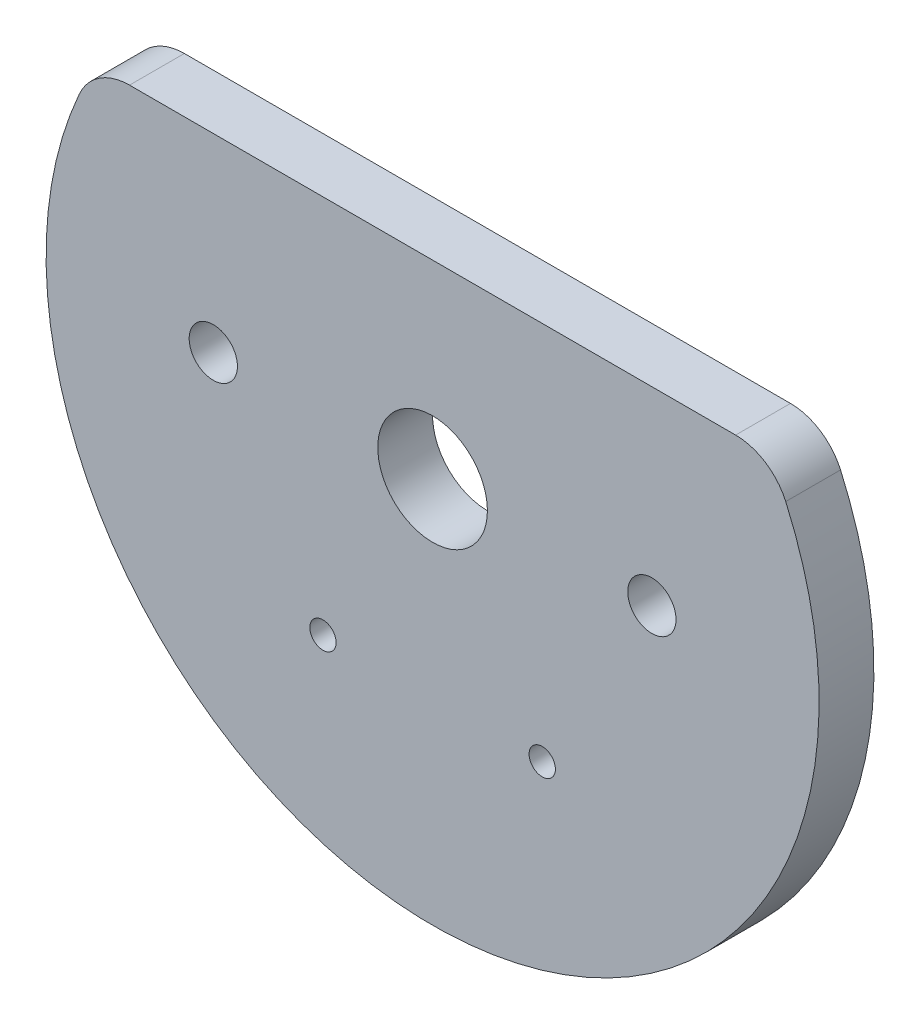
ISO-10303-21;
HEADER;
FILE_DESCRIPTION(('STEP AP214'),'2;1');
FILE_NAME('part.step','',(''),(''),'','','');
FILE_SCHEMA(('AUTOMOTIVE_DESIGN { 1 0 10303 214 1 1 1 1 }'));
ENDSEC;
DATA;
#1=APPLICATION_CONTEXT('core data for automotive mechanical design processes');
#2=APPLICATION_PROTOCOL_DEFINITION('international standard','automotive_design',2000,#1);
#3=PRODUCT_CONTEXT('',#1,'mechanical');
#4=PRODUCT('Part','Part','',(#3));
#5=PRODUCT_RELATED_PRODUCT_CATEGORY('part','',(#4));
#6=PRODUCT_DEFINITION_FORMATION('','',#4);
#7=PRODUCT_DEFINITION_CONTEXT('part definition',#1,'design');
#8=PRODUCT_DEFINITION('design','',#6,#7);
#9=PRODUCT_DEFINITION_SHAPE('','',#8);
#10=(LENGTH_UNIT() NAMED_UNIT(*) SI_UNIT(.MILLI.,.METRE.));
#11=(NAMED_UNIT(*) PLANE_ANGLE_UNIT() SI_UNIT($,.RADIAN.));
#12=(NAMED_UNIT(*) SI_UNIT($,.STERADIAN.) SOLID_ANGLE_UNIT());
#13=UNCERTAINTY_MEASURE_WITH_UNIT(LENGTH_MEASURE(1.E-05),#10,'distance_accuracy_value','');
#14=(GEOMETRIC_REPRESENTATION_CONTEXT(3) GLOBAL_UNCERTAINTY_ASSIGNED_CONTEXT((#13)) GLOBAL_UNIT_ASSIGNED_CONTEXT((#10,
#11,#12)) REPRESENTATION_CONTEXT('',''));
#15=CARTESIAN_POINT('',(0.,0.,0.));
#16=DIRECTION('',(0.,0.,1.));
#17=DIRECTION('',(1.,0.,0.));
#18=AXIS2_PLACEMENT_3D('',#15,#16,#17);
#19=CARTESIAN_POINT('',(69.0541023726342,-28.6031457402453,3.175));
#20=DIRECTION('',(0.,0.,-1.));
#21=DIRECTION('',(-1.,0.,0.));
#22=AXIS2_PLACEMENT_3D('',#19,#20,#21);
#23=CYLINDRICAL_SURFACE('',#22,22.38375);
#24=CARTESIAN_POINT('',(69.0541023726342,-28.6031457402453,0.));
#25=DIRECTION('',(0.,0.,1.));
#26=DIRECTION('',(1.,0.,0.));
#27=AXIS2_PLACEMENT_3D('',#24,#25,#26);
#28=CIRCLE('',#27,22.38375);
#29=CARTESIAN_POINT('',(48.6023586338379,-19.5059790326871,0.));
#30=VERTEX_POINT('',#29);
#31=CARTESIAN_POINT('',(89.5058461114306,-19.5059790326871,0.));
#32=VERTEX_POINT('',#31);
#33=EDGE_CURVE('E37',#30,#32,#28,.T.);
#34=ORIENTED_EDGE('',*,*,#33,.T.);
#35=DIRECTION('',(0.,0.,-1.));
#36=VECTOR('',#35,1.);
#37=CARTESIAN_POINT('',(89.5058461114306,-19.5059790326871,1.5875));
#38=LINE('',#37,#36);
#39=CARTESIAN_POINT('',(89.5058461114306,-19.5059790326871,3.175));
#40=VERTEX_POINT('',#39);
#41=EDGE_CURVE('E123',#40,#32,#38,.T.);
#42=ORIENTED_EDGE('',*,*,#41,.F.);
#43=CARTESIAN_POINT('',(69.0541023726342,-28.6031457402453,3.175));
#44=DIRECTION('',(0.,0.,1.));
#45=DIRECTION('',(1.,0.,0.));
#46=AXIS2_PLACEMENT_3D('',#43,#44,#45);
#47=CIRCLE('',#46,22.38375);
#48=CARTESIAN_POINT('',(48.6023586338379,-19.5059790326872,3.175));
#49=VERTEX_POINT('',#48);
#50=EDGE_CURVE('E11',#49,#40,#47,.T.);
#51=ORIENTED_EDGE('',*,*,#50,.F.);
#52=DIRECTION('',(0.,0.,-1.));
#53=VECTOR('',#52,1.);
#54=CARTESIAN_POINT('',(48.6023586338379,-19.5059790326872,1.5875));
#55=LINE('',#54,#53);
#56=EDGE_CURVE('E121',#30,#49,#55,.F.);
#57=ORIENTED_EDGE('',*,*,#56,.F.);
#58=EDGE_LOOP('',(#34,#42,#51,#57));
#59=FACE_BOUND('',#58,.T.);
#60=ADVANCED_FACE('F34',(#59),#23,.T.);
#61=CARTESIAN_POINT('',(69.0541023726342,-28.6031457402453,3.175));
#62=DIRECTION('',(0.,0.,1.));
#63=DIRECTION('',(1.,0.,0.));
#64=AXIS2_PLACEMENT_3D('',#61,#62,#63);
#65=PLANE('',#64);
#66=CARTESIAN_POINT('',(69.0541023726342,-28.6031457402453,3.175));
#67=DIRECTION('',(0.,0.,1.));
#68=DIRECTION('',(1.,0.,0.));
#69=AXIS2_PLACEMENT_3D('',#66,#67,#68);
#70=CIRCLE('',#69,3.175);
#71=CARTESIAN_POINT('',(72.2291023726342,-28.6031457402453,3.175));
#72=VERTEX_POINT('',#71);
#73=EDGE_CURVE('E169',#72,#72,#70,.T.);
#74=ORIENTED_EDGE('',*,*,#73,.F.);
#75=EDGE_LOOP('',(#74));
#76=FACE_BOUND('',#75,.T.);
#77=CARTESIAN_POINT('',(75.4041023726343,-39.6016683683077,3.175));
#78=DIRECTION('',(0.,0.,1.));
#79=DIRECTION('',(1.,0.,0.));
#80=AXIS2_PLACEMENT_3D('',#77,#78,#79);
#81=CIRCLE('',#80,0.762000000000003);
#82=CARTESIAN_POINT('',(76.1661023726343,-39.6016683683077,3.175));
#83=VERTEX_POINT('',#82);
#84=EDGE_CURVE('E96',#83,#83,#81,.T.);
#85=ORIENTED_EDGE('',*,*,#84,.F.);
#86=EDGE_LOOP('',(#85));
#87=FACE_BOUND('',#86,.T.);
#88=CARTESIAN_POINT('',(62.7041023726342,-39.6016683683077,3.175));
#89=DIRECTION('',(0.,0.,1.));
#90=DIRECTION('',(1.,0.,0.));
#91=AXIS2_PLACEMENT_3D('',#88,#89,#90);
#92=CIRCLE('',#91,0.762000000000003);
#93=CARTESIAN_POINT('',(63.4661023726342,-39.6016683683077,3.175));
#94=VERTEX_POINT('',#93);
#95=EDGE_CURVE('E103',#94,#94,#92,.T.);
#96=ORIENTED_EDGE('',*,*,#95,.F.);
#97=EDGE_LOOP('',(#96));
#98=FACE_BOUND('',#97,.T.);
#99=CARTESIAN_POINT('',(81.7541023726343,-28.6031457402453,3.175));
#100=DIRECTION('',(0.,0.,1.));
#101=DIRECTION('',(-1.,0.,0.));
#102=AXIS2_PLACEMENT_3D('',#99,#100,#101);
#103=CIRCLE('',#102,1.39699999999999);
#104=CARTESIAN_POINT('',(80.3571023726343,-28.6031457402453,3.175));
#105=VERTEX_POINT('',#104);
#106=EDGE_CURVE('E109',#105,#105,#103,.T.);
#107=ORIENTED_EDGE('',*,*,#106,.F.);
#108=EDGE_LOOP('',(#107));
#109=FACE_BOUND('',#108,.T.);
#110=CARTESIAN_POINT('',(56.3541023726342,-28.6031457402453,3.175));
#111=DIRECTION('',(0.,0.,1.));
#112=DIRECTION('',(1.,0.,0.));
#113=AXIS2_PLACEMENT_3D('',#110,#111,#112);
#114=CIRCLE('',#113,1.39700000000001);
#115=CARTESIAN_POINT('',(57.7511023726343,-28.6031457402453,3.175));
#116=VERTEX_POINT('',#115);
#117=EDGE_CURVE('E115',#116,#116,#114,.T.);
#118=ORIENTED_EDGE('',*,*,#117,.F.);
#119=EDGE_LOOP('',(#118));
#120=FACE_BOUND('',#119,.T.);
#121=ORIENTED_EDGE('',*,*,#50,.T.);
#122=CARTESIAN_POINT('',(86.6048895527361,-20.7963572890784,3.175));
#123=DIRECTION('',(0.,0.,1.));
#124=DIRECTION('',(1.,0.,0.));
#125=AXIS2_PLACEMENT_3D('',#122,#123,#124);
#126=CIRCLE('',#125,3.17500000000001);
#127=CARTESIAN_POINT('',(86.6048895527361,-17.6213572890784,3.175));
#128=VERTEX_POINT('',#127);
#129=EDGE_CURVE('E75',#40,#128,#126,.T.);
#130=ORIENTED_EDGE('',*,*,#129,.T.);
#131=DIRECTION('',(-1.,0.,0.));
#132=VECTOR('',#131,1.);
#133=CARTESIAN_POINT('',(51.5033151925324,-17.6213572890784,3.175));
#134=LINE('',#133,#132);
#135=CARTESIAN_POINT('',(51.5033151925324,-17.6213572890784,3.175));
#136=VERTEX_POINT('',#135);
#137=EDGE_CURVE('E81',#128,#136,#134,.T.);
#138=ORIENTED_EDGE('',*,*,#137,.T.);
#139=CARTESIAN_POINT('',(51.5033151925324,-20.7963572890784,3.175));
#140=DIRECTION('',(0.,0.,1.));
#141=DIRECTION('',(-1.,0.,0.));
#142=AXIS2_PLACEMENT_3D('',#139,#140,#141);
#143=CIRCLE('',#142,3.175);
#144=EDGE_CURVE('E87',#136,#49,#143,.T.);
#145=ORIENTED_EDGE('',*,*,#144,.T.);
#146=EDGE_LOOP('',(#121,#130,#138,#145));
#147=FACE_BOUND('',#146,.T.);
#148=ADVANCED_FACE('F85',(#76,#87,#98,#109,#120,#147),#65,.T.);
#149=CARTESIAN_POINT('',(69.0541023726342,-28.6031457402453,0.));
#150=DIRECTION('',(0.,0.,1.));
#151=DIRECTION('',(1.,0.,0.));
#152=AXIS2_PLACEMENT_3D('',#149,#150,#151);
#153=PLANE('',#152);
#154=CARTESIAN_POINT('',(69.0541023726342,-28.6031457402453,0.));
#155=DIRECTION('',(0.,0.,1.));
#156=DIRECTION('',(1.,0.,0.));
#157=AXIS2_PLACEMENT_3D('',#154,#155,#156);
#158=CIRCLE('',#157,3.175);
#159=CARTESIAN_POINT('',(72.2291023726342,-28.6031457402453,0.));
#160=VERTEX_POINT('',#159);
#161=EDGE_CURVE('E172',#160,#160,#158,.F.);
#162=ORIENTED_EDGE('',*,*,#161,.F.);
#163=EDGE_LOOP('',(#162));
#164=FACE_BOUND('',#163,.T.);
#165=CARTESIAN_POINT('',(75.4041023726343,-39.6016683683077,0.));
#166=DIRECTION('',(0.,0.,1.));
#167=DIRECTION('',(1.,0.,0.));
#168=AXIS2_PLACEMENT_3D('',#165,#166,#167);
#169=CIRCLE('',#168,0.762000000000003);
#170=CARTESIAN_POINT('',(76.1661023726343,-39.6016683683077,0.));
#171=VERTEX_POINT('',#170);
#172=EDGE_CURVE('E99',#171,#171,#169,.F.);
#173=ORIENTED_EDGE('',*,*,#172,.F.);
#174=EDGE_LOOP('',(#173));
#175=FACE_BOUND('',#174,.T.);
#176=CARTESIAN_POINT('',(62.7041023726342,-39.6016683683077,0.));
#177=DIRECTION('',(0.,0.,1.));
#178=DIRECTION('',(1.,0.,0.));
#179=AXIS2_PLACEMENT_3D('',#176,#177,#178);
#180=CIRCLE('',#179,0.762000000000003);
#181=CARTESIAN_POINT('',(63.4661023726342,-39.6016683683077,0.));
#182=VERTEX_POINT('',#181);
#183=EDGE_CURVE('E106',#182,#182,#180,.F.);
#184=ORIENTED_EDGE('',*,*,#183,.F.);
#185=EDGE_LOOP('',(#184));
#186=FACE_BOUND('',#185,.T.);
#187=CARTESIAN_POINT('',(81.7541023726343,-28.6031457402453,0.));
#188=DIRECTION('',(0.,0.,1.));
#189=DIRECTION('',(1.,0.,0.));
#190=AXIS2_PLACEMENT_3D('',#187,#188,#189);
#191=CIRCLE('',#190,1.39699999999999);
#192=CARTESIAN_POINT('',(83.1511023726342,-28.6031457402453,0.));
#193=VERTEX_POINT('',#192);
#194=EDGE_CURVE('E112',#193,#193,#191,.F.);
#195=ORIENTED_EDGE('',*,*,#194,.F.);
#196=EDGE_LOOP('',(#195));
#197=FACE_BOUND('',#196,.T.);
#198=CARTESIAN_POINT('',(56.3541023726342,-28.6031457402453,0.));
#199=DIRECTION('',(0.,0.,1.));
#200=DIRECTION('',(1.,0.,0.));
#201=AXIS2_PLACEMENT_3D('',#198,#199,#200);
#202=CIRCLE('',#201,1.39700000000001);
#203=CARTESIAN_POINT('',(57.7511023726343,-28.6031457402453,0.));
#204=VERTEX_POINT('',#203);
#205=EDGE_CURVE('E118',#204,#204,#202,.F.);
#206=ORIENTED_EDGE('',*,*,#205,.F.);
#207=EDGE_LOOP('',(#206));
#208=FACE_BOUND('',#207,.T.);
#209=ORIENTED_EDGE('',*,*,#33,.F.);
#210=CARTESIAN_POINT('',(51.5033151925324,-20.7963572890784,0.));
#211=DIRECTION('',(0.,0.,1.));
#212=DIRECTION('',(1.,0.,0.));
#213=AXIS2_PLACEMENT_3D('',#210,#211,#212);
#214=CIRCLE('',#213,3.175);
#215=CARTESIAN_POINT('',(51.5033151925324,-17.6213572890784,0.));
#216=VERTEX_POINT('',#215);
#217=EDGE_CURVE('E100',#30,#216,#214,.F.);
#218=ORIENTED_EDGE('',*,*,#217,.T.);
#219=DIRECTION('',(1.,0.,0.));
#220=VECTOR('',#219,1.);
#221=CARTESIAN_POINT('',(51.5033151925324,-17.6213572890784,0.));
#222=LINE('',#221,#220);
#223=CARTESIAN_POINT('',(86.6048895527361,-17.6213572890784,0.));
#224=VERTEX_POINT('',#223);
#225=EDGE_CURVE('E177',#216,#224,#222,.T.);
#226=ORIENTED_EDGE('',*,*,#225,.T.);
#227=CARTESIAN_POINT('',(86.6048895527361,-20.7963572890784,0.));
#228=DIRECTION('',(0.,0.,1.));
#229=DIRECTION('',(1.,0.,0.));
#230=AXIS2_PLACEMENT_3D('',#227,#228,#229);
#231=CIRCLE('',#230,3.17500000000001);
#232=EDGE_CURVE('E76',#224,#32,#231,.F.);
#233=ORIENTED_EDGE('',*,*,#232,.T.);
#234=EDGE_LOOP('',(#209,#218,#226,#233));
#235=FACE_BOUND('',#234,.T.);
#236=ADVANCED_FACE('F128',(#164,#175,#186,#197,#208,#235),#153,.F.);
#237=CARTESIAN_POINT('',(56.3541023726342,-28.6031457402453,-0.00100000000000013));
#238=DIRECTION('',(0.,0.,1.));
#239=DIRECTION('',(1.,0.,0.));
#240=AXIS2_PLACEMENT_3D('',#237,#238,#239);
#241=CYLINDRICAL_SURFACE('',#240,1.39700000000001);
#242=ORIENTED_EDGE('',*,*,#117,.T.);
#243=EDGE_LOOP('',(#242));
#244=FACE_BOUND('',#243,.T.);
#245=ORIENTED_EDGE('',*,*,#205,.T.);
#246=EDGE_LOOP('',(#245));
#247=FACE_BOUND('',#246,.T.);
#248=ADVANCED_FACE('F134',(#244,#247),#241,.F.);
#249=CARTESIAN_POINT('',(81.7541023726343,-28.6031457402453,-0.00100000000000013));
#250=DIRECTION('',(0.,0.,1.));
#251=DIRECTION('',(1.,0.,0.));
#252=AXIS2_PLACEMENT_3D('',#249,#250,#251);
#253=CYLINDRICAL_SURFACE('',#252,1.39699999999999);
#254=ORIENTED_EDGE('',*,*,#106,.T.);
#255=EDGE_LOOP('',(#254));
#256=FACE_BOUND('',#255,.T.);
#257=ORIENTED_EDGE('',*,*,#194,.T.);
#258=EDGE_LOOP('',(#257));
#259=FACE_BOUND('',#258,.T.);
#260=ADVANCED_FACE('F141',(#256,#259),#253,.F.);
#261=CARTESIAN_POINT('',(62.7041023726342,-39.6016683683077,-0.00100000000000013));
#262=DIRECTION('',(0.,0.,1.));
#263=DIRECTION('',(1.,0.,0.));
#264=AXIS2_PLACEMENT_3D('',#261,#262,#263);
#265=CYLINDRICAL_SURFACE('',#264,0.762000000000003);
#266=ORIENTED_EDGE('',*,*,#95,.T.);
#267=EDGE_LOOP('',(#266));
#268=FACE_BOUND('',#267,.T.);
#269=ORIENTED_EDGE('',*,*,#183,.T.);
#270=EDGE_LOOP('',(#269));
#271=FACE_BOUND('',#270,.T.);
#272=ADVANCED_FACE('F145',(#268,#271),#265,.F.);
#273=CARTESIAN_POINT('',(75.4041023726343,-39.6016683683077,-0.00100000000000013));
#274=DIRECTION('',(0.,0.,1.));
#275=DIRECTION('',(1.,0.,0.));
#276=AXIS2_PLACEMENT_3D('',#273,#274,#275);
#277=CYLINDRICAL_SURFACE('',#276,0.762000000000003);
#278=ORIENTED_EDGE('',*,*,#84,.T.);
#279=EDGE_LOOP('',(#278));
#280=FACE_BOUND('',#279,.T.);
#281=ORIENTED_EDGE('',*,*,#172,.T.);
#282=EDGE_LOOP('',(#281));
#283=FACE_BOUND('',#282,.T.);
#284=ADVANCED_FACE('F149',(#280,#283),#277,.F.);
#285=CARTESIAN_POINT('',(51.5033151925324,-20.7963572890784,-41.6500884203599));
#286=DIRECTION('',(0.,0.,1.));
#287=DIRECTION('',(1.,0.,0.));
#288=AXIS2_PLACEMENT_3D('',#285,#286,#287);
#289=CYLINDRICAL_SURFACE('',#288,3.175);
#290=ORIENTED_EDGE('',*,*,#217,.F.);
#291=ORIENTED_EDGE('',*,*,#56,.T.);
#292=ORIENTED_EDGE('',*,*,#144,.F.);
#293=DIRECTION('',(0.,0.,1.));
#294=VECTOR('',#293,1.);
#295=CARTESIAN_POINT('',(51.5033151925324,-17.6213572890784,-41.6500884203599));
#296=LINE('',#295,#294);
#297=EDGE_CURVE('E80',#216,#136,#296,.T.);
#298=ORIENTED_EDGE('',*,*,#297,.F.);
#299=EDGE_LOOP('',(#290,#291,#292,#298));
#300=FACE_BOUND('',#299,.T.);
#301=ADVANCED_FACE('F153',(#300),#289,.T.);
#302=CARTESIAN_POINT('',(51.5033151925324,-17.6213572890784,-41.6500884203599));
#303=DIRECTION('',(0.,1.,0.));
#304=DIRECTION('',(0.,0.,1.));
#305=AXIS2_PLACEMENT_3D('',#302,#303,#304);
#306=PLANE('',#305);
#307=ORIENTED_EDGE('',*,*,#225,.F.);
#308=ORIENTED_EDGE('',*,*,#297,.T.);
#309=ORIENTED_EDGE('',*,*,#137,.F.);
#310=DIRECTION('',(0.,0.,1.));
#311=VECTOR('',#310,1.);
#312=CARTESIAN_POINT('',(86.6048895527361,-17.6213572890784,-41.6500884203599));
#313=LINE('',#312,#311);
#314=EDGE_CURVE('E71',#224,#128,#313,.T.);
#315=ORIENTED_EDGE('',*,*,#314,.F.);
#316=EDGE_LOOP('',(#307,#308,#309,#315));
#317=FACE_BOUND('',#316,.T.);
#318=ADVANCED_FACE('F89',(#317),#306,.T.);
#319=CARTESIAN_POINT('',(86.6048895527361,-20.7963572890784,-41.6500884203599));
#320=DIRECTION('',(0.,0.,1.));
#321=DIRECTION('',(1.,0.,0.));
#322=AXIS2_PLACEMENT_3D('',#319,#320,#321);
#323=CYLINDRICAL_SURFACE('',#322,3.17500000000001);
#324=ORIENTED_EDGE('',*,*,#232,.F.);
#325=ORIENTED_EDGE('',*,*,#314,.T.);
#326=ORIENTED_EDGE('',*,*,#129,.F.);
#327=ORIENTED_EDGE('',*,*,#41,.T.);
#328=EDGE_LOOP('',(#324,#325,#326,#327));
#329=FACE_BOUND('',#328,.T.);
#330=ADVANCED_FACE('F73',(#329),#323,.T.);
#331=CARTESIAN_POINT('',(69.0541023726342,-28.6031457402453,-0.00100000000000013));
#332=DIRECTION('',(0.,0.,1.));
#333=DIRECTION('',(1.,0.,0.));
#334=AXIS2_PLACEMENT_3D('',#331,#332,#333);
#335=CYLINDRICAL_SURFACE('',#334,3.175);
#336=ORIENTED_EDGE('',*,*,#73,.T.);
#337=EDGE_LOOP('',(#336));
#338=FACE_BOUND('',#337,.T.);
#339=ORIENTED_EDGE('',*,*,#161,.T.);
#340=EDGE_LOOP('',(#339));
#341=FACE_BOUND('',#340,.T.);
#342=ADVANCED_FACE('F160',(#338,#341),#335,.F.);
#343=CLOSED_SHELL('',(#60,#148,#236,#248,#260,#272,#284,#301,#318,#330,#342));
#344=MANIFOLD_SOLID_BREP('B2',#343);
#345=ADVANCED_BREP_SHAPE_REPRESENTATION('',(#18,#344),#14);
#346=SHAPE_DEFINITION_REPRESENTATION(#9,#345);
ENDSEC;
END-ISO-10303-21;
